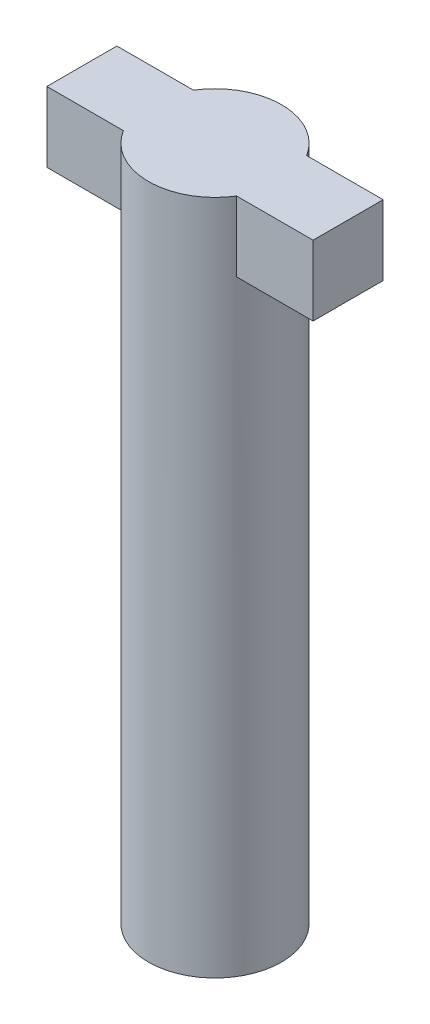
ISO-10303-21;
HEADER;
FILE_DESCRIPTION(('STEP AP214'),'2;1');
FILE_NAME('part.step','',(''),(''),'','','');
FILE_SCHEMA(('AUTOMOTIVE_DESIGN { 1 0 10303 214 1 1 1 1 }'));
ENDSEC;
DATA;
#1=APPLICATION_CONTEXT('core data for automotive mechanical design processes');
#2=APPLICATION_PROTOCOL_DEFINITION('international standard','automotive_design',2000,#1);
#3=PRODUCT_CONTEXT('',#1,'mechanical');
#4=PRODUCT('Part','Part','',(#3));
#5=PRODUCT_RELATED_PRODUCT_CATEGORY('part','',(#4));
#6=PRODUCT_DEFINITION_FORMATION('','',#4);
#7=PRODUCT_DEFINITION_CONTEXT('part definition',#1,'design');
#8=PRODUCT_DEFINITION('design','',#6,#7);
#9=PRODUCT_DEFINITION_SHAPE('','',#8);
#10=(LENGTH_UNIT() NAMED_UNIT(*) SI_UNIT(.MILLI.,.METRE.));
#11=(NAMED_UNIT(*) PLANE_ANGLE_UNIT() SI_UNIT($,.RADIAN.));
#12=(NAMED_UNIT(*) SI_UNIT($,.STERADIAN.) SOLID_ANGLE_UNIT());
#13=UNCERTAINTY_MEASURE_WITH_UNIT(LENGTH_MEASURE(1.E-05),#10,'distance_accuracy_value','');
#14=(GEOMETRIC_REPRESENTATION_CONTEXT(3) GLOBAL_UNCERTAINTY_ASSIGNED_CONTEXT((#13)) GLOBAL_UNIT_ASSIGNED_CONTEXT((#10,
#11,#12)) REPRESENTATION_CONTEXT('',''));
#15=CARTESIAN_POINT('',(0.,0.,0.));
#16=DIRECTION('',(0.,0.,1.));
#17=DIRECTION('',(1.,0.,0.));
#18=AXIS2_PLACEMENT_3D('',#15,#16,#17);
#19=CARTESIAN_POINT('',(0.,9.65,0.));
#20=DIRECTION('',(0.,-1.,0.));
#21=DIRECTION('',(0.,0.,-1.));
#22=AXIS2_PLACEMENT_3D('',#19,#20,#21);
#23=CYLINDRICAL_SURFACE('',#22,0.95);
#24=CARTESIAN_POINT('',(0.,8.65,0.));
#25=DIRECTION('',(0.,1.,0.));
#26=DIRECTION('',(0.,0.,1.));
#27=AXIS2_PLACEMENT_3D('',#24,#25,#26);
#28=CIRCLE('',#27,0.95);
#29=CARTESIAN_POINT('',(-0.807774721070176,8.65,-0.5));
#30=VERTEX_POINT('',#29);
#31=CARTESIAN_POINT('',(-0.807774721070176,8.65,0.5));
#32=VERTEX_POINT('',#31);
#33=EDGE_CURVE('E124',#30,#32,#28,.T.);
#34=ORIENTED_EDGE('',*,*,#33,.F.);
#35=DIRECTION('',(0.,1.,0.));
#36=VECTOR('',#35,1.);
#37=CARTESIAN_POINT('',(-0.807774721070176,8.65,-0.5));
#38=LINE('',#37,#36);
#39=CARTESIAN_POINT('',(-0.807774721070176,9.65,-0.5));
#40=VERTEX_POINT('',#39);
#41=EDGE_CURVE('E138',#30,#40,#38,.T.);
#42=ORIENTED_EDGE('',*,*,#41,.T.);
#43=CARTESIAN_POINT('',(0.,9.65,0.));
#44=DIRECTION('',(0.,1.,0.));
#45=DIRECTION('',(0.,0.,1.));
#46=AXIS2_PLACEMENT_3D('',#43,#44,#45);
#47=CIRCLE('',#46,0.95);
#48=CARTESIAN_POINT('',(0.807774721070176,9.65,-0.5));
#49=VERTEX_POINT('',#48);
#50=EDGE_CURVE('E11',#49,#40,#47,.T.);
#51=ORIENTED_EDGE('',*,*,#50,.F.);
#52=DIRECTION('',(0.,1.,0.));
#53=VECTOR('',#52,1.);
#54=CARTESIAN_POINT('',(0.807774721070176,8.65,-0.5));
#55=LINE('',#54,#53);
#56=CARTESIAN_POINT('',(0.807774721070176,8.65,-0.5));
#57=VERTEX_POINT('',#56);
#58=EDGE_CURVE('E176',#57,#49,#55,.T.);
#59=ORIENTED_EDGE('',*,*,#58,.F.);
#60=CARTESIAN_POINT('',(0.,8.65,0.));
#61=DIRECTION('',(0.,1.,0.));
#62=DIRECTION('',(0.,0.,1.));
#63=AXIS2_PLACEMENT_3D('',#60,#61,#62);
#64=CIRCLE('',#63,0.95);
#65=CARTESIAN_POINT('',(0.807774721070176,8.65,0.5));
#66=VERTEX_POINT('',#65);
#67=EDGE_CURVE('E165',#66,#57,#64,.T.);
#68=ORIENTED_EDGE('',*,*,#67,.F.);
#69=DIRECTION('',(0.,1.,0.));
#70=VECTOR('',#69,1.);
#71=CARTESIAN_POINT('',(0.807774721070176,8.65,0.5));
#72=LINE('',#71,#70);
#73=CARTESIAN_POINT('',(0.807774721070176,9.65,0.5));
#74=VERTEX_POINT('',#73);
#75=EDGE_CURVE('E192',#66,#74,#72,.T.);
#76=ORIENTED_EDGE('',*,*,#75,.T.);
#77=CARTESIAN_POINT('',(-0.807774721070176,9.65,0.5));
#78=VERTEX_POINT('',#77);
#79=EDGE_CURVE('E56',#78,#74,#47,.T.);
#80=ORIENTED_EDGE('',*,*,#79,.F.);
#81=DIRECTION('',(0.,1.,0.));
#82=VECTOR('',#81,1.);
#83=CARTESIAN_POINT('',(-0.807774721070176,8.65,0.5));
#84=LINE('',#83,#82);
#85=EDGE_CURVE('E156',#32,#78,#84,.T.);
#86=ORIENTED_EDGE('',*,*,#85,.F.);
#87=EDGE_LOOP('',(#34,#42,#51,#59,#68,#76,#80,#86));
#88=FACE_BOUND('',#87,.T.);
#89=CARTESIAN_POINT('',(0.,0.,0.));
#90=DIRECTION('',(0.,1.,0.));
#91=DIRECTION('',(0.,0.,1.));
#92=AXIS2_PLACEMENT_3D('',#89,#90,#91);
#93=CIRCLE('',#92,0.95);
#94=CARTESIAN_POINT('',(0.,0.,0.95));
#95=VERTEX_POINT('',#94);
#96=EDGE_CURVE('E50',#95,#95,#93,.T.);
#97=ORIENTED_EDGE('',*,*,#96,.T.);
#98=EDGE_LOOP('',(#97));
#99=FACE_BOUND('',#98,.T.);
#100=ADVANCED_FACE('F47',(#88,#99),#23,.T.);
#101=CARTESIAN_POINT('',(0.,9.65,0.));
#102=DIRECTION('',(0.,1.,0.));
#103=DIRECTION('',(0.,0.,1.));
#104=AXIS2_PLACEMENT_3D('',#101,#102,#103);
#105=PLANE('',#104);
#106=ORIENTED_EDGE('',*,*,#79,.T.);
#107=DIRECTION('',(1.,0.,0.));
#108=VECTOR('',#107,1.);
#109=CARTESIAN_POINT('',(0.,9.65,0.5));
#110=LINE('',#109,#108);
#111=CARTESIAN_POINT('',(1.9,9.65,0.5));
#112=VERTEX_POINT('',#111);
#113=EDGE_CURVE('E179',#74,#112,#110,.T.);
#114=ORIENTED_EDGE('',*,*,#113,.T.);
#115=DIRECTION('',(0.,0.,1.));
#116=VECTOR('',#115,1.);
#117=CARTESIAN_POINT('',(1.9,9.65,0.));
#118=LINE('',#117,#116);
#119=CARTESIAN_POINT('',(1.9,9.65,-0.5));
#120=VERTEX_POINT('',#119);
#121=EDGE_CURVE('E166',#120,#112,#118,.T.);
#122=ORIENTED_EDGE('',*,*,#121,.F.);
#123=DIRECTION('',(1.,0.,0.));
#124=VECTOR('',#123,1.);
#125=CARTESIAN_POINT('',(0.,9.65,-0.5));
#126=LINE('',#125,#124);
#127=EDGE_CURVE('E69',#49,#120,#126,.T.);
#128=ORIENTED_EDGE('',*,*,#127,.F.);
#129=ORIENTED_EDGE('',*,*,#50,.T.);
#130=DIRECTION('',(-1.,0.,0.));
#131=VECTOR('',#130,1.);
#132=CARTESIAN_POINT('',(0.,9.65,-0.5));
#133=LINE('',#132,#131);
#134=CARTESIAN_POINT('',(-1.9,9.65,-0.5));
#135=VERTEX_POINT('',#134);
#136=EDGE_CURVE('E148',#40,#135,#133,.T.);
#137=ORIENTED_EDGE('',*,*,#136,.T.);
#138=DIRECTION('',(0.,0.,1.));
#139=VECTOR('',#138,1.);
#140=CARTESIAN_POINT('',(-1.9,9.65,0.));
#141=LINE('',#140,#139);
#142=CARTESIAN_POINT('',(-1.9,9.65,0.5));
#143=VERTEX_POINT('',#142);
#144=EDGE_CURVE('E118',#135,#143,#141,.T.);
#145=ORIENTED_EDGE('',*,*,#144,.T.);
#146=DIRECTION('',(-1.,0.,0.));
#147=VECTOR('',#146,1.);
#148=CARTESIAN_POINT('',(0.,9.65,0.5));
#149=LINE('',#148,#147);
#150=EDGE_CURVE('E63',#78,#143,#149,.T.);
#151=ORIENTED_EDGE('',*,*,#150,.F.);
#152=EDGE_LOOP('',(#106,#114,#122,#128,#129,#137,#145,#151));
#153=FACE_BOUND('',#152,.T.);
#154=ADVANCED_FACE('F207',(#153),#105,.T.);
#155=CARTESIAN_POINT('',(0.,0.,0.));
#156=DIRECTION('',(0.,1.,0.));
#157=DIRECTION('',(0.,0.,1.));
#158=AXIS2_PLACEMENT_3D('',#155,#156,#157);
#159=PLANE('',#158);
#160=ORIENTED_EDGE('',*,*,#96,.F.);
#161=EDGE_LOOP('',(#160));
#162=FACE_BOUND('',#161,.T.);
#163=ADVANCED_FACE('F204',(#162),#159,.F.);
#164=CARTESIAN_POINT('',(0.,8.65,-0.5));
#165=DIRECTION('',(0.,0.,1.));
#166=DIRECTION('',(1.,0.,0.));
#167=AXIS2_PLACEMENT_3D('',#164,#165,#166);
#168=PLANE('',#167);
#169=ORIENTED_EDGE('',*,*,#127,.T.);
#170=DIRECTION('',(0.,1.,0.));
#171=VECTOR('',#170,1.);
#172=CARTESIAN_POINT('',(1.9,8.65,-0.5));
#173=LINE('',#172,#171);
#174=CARTESIAN_POINT('',(1.9,8.65,-0.5));
#175=VERTEX_POINT('',#174);
#176=EDGE_CURVE('E151',#175,#120,#173,.T.);
#177=ORIENTED_EDGE('',*,*,#176,.F.);
#178=DIRECTION('',(1.,0.,0.));
#179=VECTOR('',#178,1.);
#180=CARTESIAN_POINT('',(0.,8.65,-0.5));
#181=LINE('',#180,#179);
#182=EDGE_CURVE('E161',#57,#175,#181,.T.);
#183=ORIENTED_EDGE('',*,*,#182,.F.);
#184=ORIENTED_EDGE('',*,*,#58,.T.);
#185=EDGE_LOOP('',(#169,#177,#183,#184));
#186=FACE_BOUND('',#185,.T.);
#187=ADVANCED_FACE('F206',(#186),#168,.F.);
#188=CARTESIAN_POINT('',(1.9,8.65,0.));
#189=DIRECTION('',(-1.,0.,0.));
#190=DIRECTION('',(0.,0.,1.));
#191=AXIS2_PLACEMENT_3D('',#188,#189,#190);
#192=PLANE('',#191);
#193=ORIENTED_EDGE('',*,*,#121,.T.);
#194=DIRECTION('',(0.,1.,0.));
#195=VECTOR('',#194,1.);
#196=CARTESIAN_POINT('',(1.9,8.65,0.5));
#197=LINE('',#196,#195);
#198=CARTESIAN_POINT('',(1.9,8.65,0.5));
#199=VERTEX_POINT('',#198);
#200=EDGE_CURVE('E189',#199,#112,#197,.T.);
#201=ORIENTED_EDGE('',*,*,#200,.F.);
#202=DIRECTION('',(0.,0.,1.));
#203=VECTOR('',#202,1.);
#204=CARTESIAN_POINT('',(1.9,8.65,0.));
#205=LINE('',#204,#203);
#206=EDGE_CURVE('E173',#175,#199,#205,.T.);
#207=ORIENTED_EDGE('',*,*,#206,.F.);
#208=ORIENTED_EDGE('',*,*,#176,.T.);
#209=EDGE_LOOP('',(#193,#201,#207,#208));
#210=FACE_BOUND('',#209,.T.);
#211=ADVANCED_FACE('F212',(#210),#192,.F.);
#212=CARTESIAN_POINT('',(0.,8.65,0.5));
#213=DIRECTION('',(0.,0.,1.));
#214=DIRECTION('',(1.,0.,0.));
#215=AXIS2_PLACEMENT_3D('',#212,#213,#214);
#216=PLANE('',#215);
#217=ORIENTED_EDGE('',*,*,#113,.F.);
#218=ORIENTED_EDGE('',*,*,#75,.F.);
#219=DIRECTION('',(1.,0.,0.));
#220=VECTOR('',#219,1.);
#221=CARTESIAN_POINT('',(0.,8.65,0.5));
#222=LINE('',#221,#220);
#223=EDGE_CURVE('E169',#66,#199,#222,.T.);
#224=ORIENTED_EDGE('',*,*,#223,.T.);
#225=ORIENTED_EDGE('',*,*,#200,.T.);
#226=EDGE_LOOP('',(#217,#218,#224,#225));
#227=FACE_BOUND('',#226,.T.);
#228=ADVANCED_FACE('F233',(#227),#216,.T.);
#229=CARTESIAN_POINT('',(0.,8.65,0.));
#230=DIRECTION('',(0.,1.,0.));
#231=DIRECTION('',(0.,0.,1.));
#232=AXIS2_PLACEMENT_3D('',#229,#230,#231);
#233=PLANE('',#232);
#234=ORIENTED_EDGE('',*,*,#182,.T.);
#235=ORIENTED_EDGE('',*,*,#206,.T.);
#236=ORIENTED_EDGE('',*,*,#223,.F.);
#237=ORIENTED_EDGE('',*,*,#67,.T.);
#238=EDGE_LOOP('',(#234,#235,#236,#237));
#239=FACE_BOUND('',#238,.T.);
#240=ADVANCED_FACE('F229',(#239),#233,.F.);
#241=CARTESIAN_POINT('',(0.,8.65,-0.5));
#242=DIRECTION('',(0.,0.,-1.));
#243=DIRECTION('',(-1.,0.,0.));
#244=AXIS2_PLACEMENT_3D('',#241,#242,#243);
#245=PLANE('',#244);
#246=ORIENTED_EDGE('',*,*,#136,.F.);
#247=ORIENTED_EDGE('',*,*,#41,.F.);
#248=DIRECTION('',(-1.,0.,0.));
#249=VECTOR('',#248,1.);
#250=CARTESIAN_POINT('',(0.,8.65,-0.5));
#251=LINE('',#250,#249);
#252=CARTESIAN_POINT('',(-1.9,8.65,-0.5));
#253=VERTEX_POINT('',#252);
#254=EDGE_CURVE('E129',#30,#253,#251,.T.);
#255=ORIENTED_EDGE('',*,*,#254,.T.);
#256=DIRECTION('',(0.,1.,0.));
#257=VECTOR('',#256,1.);
#258=CARTESIAN_POINT('',(-1.9,8.65,-0.5));
#259=LINE('',#258,#257);
#260=EDGE_CURVE('E114',#253,#135,#259,.T.);
#261=ORIENTED_EDGE('',*,*,#260,.T.);
#262=EDGE_LOOP('',(#246,#247,#255,#261));
#263=FACE_BOUND('',#262,.T.);
#264=ADVANCED_FACE('F136',(#263),#245,.T.);
#265=CARTESIAN_POINT('',(0.,8.65,0.5));
#266=DIRECTION('',(0.,0.,-1.));
#267=DIRECTION('',(-1.,0.,0.));
#268=AXIS2_PLACEMENT_3D('',#265,#266,#267);
#269=PLANE('',#268);
#270=ORIENTED_EDGE('',*,*,#150,.T.);
#271=DIRECTION('',(0.,1.,0.));
#272=VECTOR('',#271,1.);
#273=CARTESIAN_POINT('',(-1.9,8.65,0.5));
#274=LINE('',#273,#272);
#275=CARTESIAN_POINT('',(-1.9,8.65,0.5));
#276=VERTEX_POINT('',#275);
#277=EDGE_CURVE('E123',#276,#143,#274,.T.);
#278=ORIENTED_EDGE('',*,*,#277,.F.);
#279=DIRECTION('',(-1.,0.,0.));
#280=VECTOR('',#279,1.);
#281=CARTESIAN_POINT('',(0.,8.65,0.5));
#282=LINE('',#281,#280);
#283=EDGE_CURVE('E132',#32,#276,#282,.T.);
#284=ORIENTED_EDGE('',*,*,#283,.F.);
#285=ORIENTED_EDGE('',*,*,#85,.T.);
#286=EDGE_LOOP('',(#270,#278,#284,#285));
#287=FACE_BOUND('',#286,.T.);
#288=ADVANCED_FACE('F223',(#287),#269,.F.);
#289=CARTESIAN_POINT('',(-1.9,8.65,0.));
#290=DIRECTION('',(-1.,0.,0.));
#291=DIRECTION('',(0.,0.,1.));
#292=AXIS2_PLACEMENT_3D('',#289,#290,#291);
#293=PLANE('',#292);
#294=ORIENTED_EDGE('',*,*,#144,.F.);
#295=ORIENTED_EDGE('',*,*,#260,.F.);
#296=DIRECTION('',(0.,0.,1.));
#297=VECTOR('',#296,1.);
#298=CARTESIAN_POINT('',(-1.9,8.65,0.));
#299=LINE('',#298,#297);
#300=EDGE_CURVE('E117',#253,#276,#299,.T.);
#301=ORIENTED_EDGE('',*,*,#300,.T.);
#302=ORIENTED_EDGE('',*,*,#277,.T.);
#303=EDGE_LOOP('',(#294,#295,#301,#302));
#304=FACE_BOUND('',#303,.T.);
#305=ADVANCED_FACE('F116',(#304),#293,.T.);
#306=CARTESIAN_POINT('',(0.,8.65,0.));
#307=DIRECTION('',(0.,1.,0.));
#308=DIRECTION('',(0.,0.,1.));
#309=AXIS2_PLACEMENT_3D('',#306,#307,#308);
#310=PLANE('',#309);
#311=ORIENTED_EDGE('',*,*,#254,.F.);
#312=ORIENTED_EDGE('',*,*,#33,.T.);
#313=ORIENTED_EDGE('',*,*,#283,.T.);
#314=ORIENTED_EDGE('',*,*,#300,.F.);
#315=EDGE_LOOP('',(#311,#312,#313,#314));
#316=FACE_BOUND('',#315,.T.);
#317=ADVANCED_FACE('F128',(#316),#310,.F.);
#318=CLOSED_SHELL('',(#100,#154,#163,#187,#211,#228,#240,#264,#288,#305,#317));
#319=MANIFOLD_SOLID_BREP('B2',#318);
#320=ADVANCED_BREP_SHAPE_REPRESENTATION('',(#18,#319),#14);
#321=SHAPE_DEFINITION_REPRESENTATION(#9,#320);
ENDSEC;
END-ISO-10303-21;
